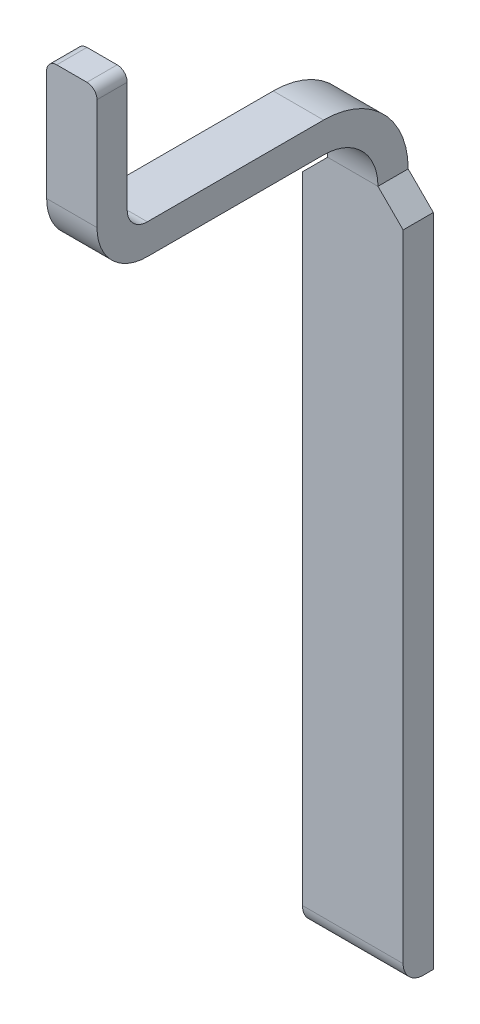
ISO-10303-21;
HEADER;
FILE_DESCRIPTION(('STEP AP214'),'2;1');
FILE_NAME('part.step','',(''),(''),'','','');
FILE_SCHEMA(('AUTOMOTIVE_DESIGN { 1 0 10303 214 1 1 1 1 }'));
ENDSEC;
DATA;
#1=APPLICATION_CONTEXT('core data for automotive mechanical design processes');
#2=APPLICATION_PROTOCOL_DEFINITION('international standard','automotive_design',2000,#1);
#3=PRODUCT_CONTEXT('',#1,'mechanical');
#4=PRODUCT('Part','Part','',(#3));
#5=PRODUCT_RELATED_PRODUCT_CATEGORY('part','',(#4));
#6=PRODUCT_DEFINITION_FORMATION('','',#4);
#7=PRODUCT_DEFINITION_CONTEXT('part definition',#1,'design');
#8=PRODUCT_DEFINITION('design','',#6,#7);
#9=PRODUCT_DEFINITION_SHAPE('','',#8);
#10=(LENGTH_UNIT() NAMED_UNIT(*) SI_UNIT(.MILLI.,.METRE.));
#11=(NAMED_UNIT(*) PLANE_ANGLE_UNIT() SI_UNIT($,.RADIAN.));
#12=(NAMED_UNIT(*) SI_UNIT($,.STERADIAN.) SOLID_ANGLE_UNIT());
#13=UNCERTAINTY_MEASURE_WITH_UNIT(LENGTH_MEASURE(1.E-05),#10,'distance_accuracy_value','');
#14=(GEOMETRIC_REPRESENTATION_CONTEXT(3) GLOBAL_UNCERTAINTY_ASSIGNED_CONTEXT((#13)) GLOBAL_UNIT_ASSIGNED_CONTEXT((#10,
#11,#12)) REPRESENTATION_CONTEXT('',''));
#15=CARTESIAN_POINT('',(0.,0.,0.));
#16=DIRECTION('',(0.,0.,1.));
#17=DIRECTION('',(1.,0.,0.));
#18=AXIS2_PLACEMENT_3D('',#15,#16,#17);
#19=CARTESIAN_POINT('',(0.9,2.03,-0.12));
#20=DIRECTION('',(0.,0.,-1.));
#21=DIRECTION('',(-1.,0.,0.));
#22=AXIS2_PLACEMENT_3D('',#19,#20,#21);
#23=PLANE('',#22);
#24=DIRECTION('',(0.,-1.,0.));
#25=VECTOR('',#24,1.);
#26=CARTESIAN_POINT('',(0.4,2.03,-0.12));
#27=LINE('',#26,#25);
#28=CARTESIAN_POINT('',(0.4,1.905,-0.12));
#29=VERTEX_POINT('',#28);
#30=CARTESIAN_POINT('',(0.4,-1.25,-0.12));
#31=VERTEX_POINT('',#30);
#32=EDGE_CURVE('E11',#29,#31,#27,.T.);
#33=ORIENTED_EDGE('',*,*,#32,.T.);
#34=DIRECTION('',(1.,0.,0.));
#35=VECTOR('',#34,1.);
#36=CARTESIAN_POINT('',(0.9,-1.25,-0.12));
#37=LINE('',#36,#35);
#38=CARTESIAN_POINT('',(0.9,-1.25,-0.12));
#39=VERTEX_POINT('',#38);
#40=EDGE_CURVE('E255',#31,#39,#37,.T.);
#41=ORIENTED_EDGE('',*,*,#40,.T.);
#42=DIRECTION('',(0.,-1.,0.));
#43=VECTOR('',#42,1.);
#44=CARTESIAN_POINT('',(0.9,2.03,-0.12));
#45=LINE('',#44,#43);
#46=CARTESIAN_POINT('',(0.9,1.905,-0.12));
#47=VERTEX_POINT('',#46);
#48=EDGE_CURVE('E26',#47,#39,#45,.T.);
#49=ORIENTED_EDGE('',*,*,#48,.F.);
#50=DIRECTION('',(-0.707106781186547,0.707106781186548,0.));
#51=VECTOR('',#50,1.);
#52=CARTESIAN_POINT('',(0.9,1.905,-0.12));
#53=LINE('',#52,#51);
#54=CARTESIAN_POINT('',(0.775,2.03,-0.12));
#55=VERTEX_POINT('',#54);
#56=EDGE_CURVE('E224',#47,#55,#53,.T.);
#57=ORIENTED_EDGE('',*,*,#56,.T.);
#58=DIRECTION('',(-1.,0.,0.));
#59=VECTOR('',#58,1.);
#60=CARTESIAN_POINT('',(0.9,2.03,-0.12));
#61=LINE('',#60,#59);
#62=CARTESIAN_POINT('',(0.525,2.03,-0.12));
#63=VERTEX_POINT('',#62);
#64=EDGE_CURVE('E263',#55,#63,#61,.T.);
#65=ORIENTED_EDGE('',*,*,#64,.T.);
#66=DIRECTION('',(-0.707106781186547,-0.707106781186548,0.));
#67=VECTOR('',#66,1.);
#68=CARTESIAN_POINT('',(0.525,2.03,-0.12));
#69=LINE('',#68,#67);
#70=EDGE_CURVE('E264',#63,#29,#69,.T.);
#71=ORIENTED_EDGE('',*,*,#70,.T.);
#72=EDGE_LOOP('',(#33,#41,#49,#57,#65,#71));
#73=FACE_BOUND('',#72,.T.);
#74=ADVANCED_FACE('F16',(#73),#23,.F.);
#75=CARTESIAN_POINT('',(0.4,-1.35,-0.27));
#76=DIRECTION('',(1.,0.,0.));
#77=DIRECTION('',(0.,-1.,0.));
#78=AXIS2_PLACEMENT_3D('',#75,#76,#77);
#79=PLANE('',#78);
#80=DIRECTION('',(0.,0.,-1.));
#81=VECTOR('',#80,1.);
#82=CARTESIAN_POINT('',(0.4,-1.35,-0.12));
#83=LINE('',#82,#81);
#84=CARTESIAN_POINT('',(0.4,-1.35,-0.22));
#85=VERTEX_POINT('',#84);
#86=CARTESIAN_POINT('',(0.4,-1.35,-0.27));
#87=VERTEX_POINT('',#86);
#88=EDGE_CURVE('E269',#85,#87,#83,.T.);
#89=ORIENTED_EDGE('',*,*,#88,.F.);
#90=CARTESIAN_POINT('',(0.4,-1.25,-0.22));
#91=DIRECTION('',(-1.,0.,0.));
#92=DIRECTION('',(0.,1.,0.));
#93=AXIS2_PLACEMENT_3D('',#90,#91,#92);
#94=CIRCLE('',#93,0.1);
#95=EDGE_CURVE('E214',#85,#31,#94,.T.);
#96=ORIENTED_EDGE('',*,*,#95,.T.);
#97=ORIENTED_EDGE('',*,*,#32,.F.);
#98=DIRECTION('',(0.,0.,-1.));
#99=VECTOR('',#98,1.);
#100=CARTESIAN_POINT('',(0.4,1.905,-0.27));
#101=LINE('',#100,#99);
#102=CARTESIAN_POINT('',(0.4,1.905,-0.27));
#103=VERTEX_POINT('',#102);
#104=EDGE_CURVE('E222',#29,#103,#101,.T.);
#105=ORIENTED_EDGE('',*,*,#104,.T.);
#106=DIRECTION('',(0.,1.,0.));
#107=VECTOR('',#106,1.);
#108=CARTESIAN_POINT('',(0.4,-1.35,-0.27));
#109=LINE('',#108,#107);
#110=EDGE_CURVE('E377',#87,#103,#109,.T.);
#111=ORIENTED_EDGE('',*,*,#110,.F.);
#112=EDGE_LOOP('',(#89,#96,#97,#105,#111));
#113=FACE_BOUND('',#112,.T.);
#114=ADVANCED_FACE('F459',(#113),#79,.F.);
#115=CARTESIAN_POINT('',(0.9,-1.35,-0.27));
#116=DIRECTION('',(1.,0.,0.));
#117=DIRECTION('',(0.,-1.,0.));
#118=AXIS2_PLACEMENT_3D('',#115,#116,#117);
#119=PLANE('',#118);
#120=ORIENTED_EDGE('',*,*,#48,.T.);
#121=CARTESIAN_POINT('',(0.9,-1.25,-0.22));
#122=DIRECTION('',(1.,0.,0.));
#123=DIRECTION('',(0.,1.,0.));
#124=AXIS2_PLACEMENT_3D('',#121,#122,#123);
#125=CIRCLE('',#124,0.1);
#126=CARTESIAN_POINT('',(0.9,-1.35,-0.22));
#127=VERTEX_POINT('',#126);
#128=EDGE_CURVE('E367',#39,#127,#125,.T.);
#129=ORIENTED_EDGE('',*,*,#128,.T.);
#130=DIRECTION('',(0.,0.,-1.));
#131=VECTOR('',#130,1.);
#132=CARTESIAN_POINT('',(0.9,-1.35,-0.12));
#133=LINE('',#132,#131);
#134=CARTESIAN_POINT('',(0.9,-1.35,-0.27));
#135=VERTEX_POINT('',#134);
#136=EDGE_CURVE('E197',#127,#135,#133,.T.);
#137=ORIENTED_EDGE('',*,*,#136,.T.);
#138=DIRECTION('',(0.,1.,0.));
#139=VECTOR('',#138,1.);
#140=CARTESIAN_POINT('',(0.9,-1.35,-0.27));
#141=LINE('',#140,#139);
#142=CARTESIAN_POINT('',(0.9,1.905,-0.27));
#143=VERTEX_POINT('',#142);
#144=EDGE_CURVE('E219',#135,#143,#141,.T.);
#145=ORIENTED_EDGE('',*,*,#144,.T.);
#146=DIRECTION('',(0.,0.,1.));
#147=VECTOR('',#146,1.);
#148=CARTESIAN_POINT('',(0.9,1.905,-0.12));
#149=LINE('',#148,#147);
#150=EDGE_CURVE('E227',#143,#47,#149,.T.);
#151=ORIENTED_EDGE('',*,*,#150,.T.);
#152=EDGE_LOOP('',(#120,#129,#137,#145,#151));
#153=FACE_BOUND('',#152,.T.);
#154=ADVANCED_FACE('F454',(#153),#119,.T.);
#155=CARTESIAN_POINT('',(0.775,2.03,0.15));
#156=DIRECTION('',(1.,0.,0.));
#157=DIRECTION('',(0.,0.,1.));
#158=AXIS2_PLACEMENT_3D('',#155,#156,#157);
#159=CYLINDRICAL_SURFACE('',#158,0.27);
#160=CARTESIAN_POINT('',(0.525,2.03,0.15));
#161=DIRECTION('',(1.,0.,0.));
#162=DIRECTION('',(0.,-1.,0.));
#163=AXIS2_PLACEMENT_3D('',#160,#161,#162);
#164=CIRCLE('',#163,0.27);
#165=CARTESIAN_POINT('',(0.525,2.3,0.15));
#166=VERTEX_POINT('',#165);
#167=EDGE_CURVE('E246',#63,#166,#164,.T.);
#168=ORIENTED_EDGE('',*,*,#167,.F.);
#169=ORIENTED_EDGE('',*,*,#64,.F.);
#170=CARTESIAN_POINT('',(0.775,2.03,0.15));
#171=DIRECTION('',(1.,0.,0.));
#172=DIRECTION('',(0.,-1.,0.));
#173=AXIS2_PLACEMENT_3D('',#170,#171,#172);
#174=CIRCLE('',#173,0.27);
#175=CARTESIAN_POINT('',(0.775,2.3,0.15));
#176=VERTEX_POINT('',#175);
#177=EDGE_CURVE('E247',#55,#176,#174,.T.);
#178=ORIENTED_EDGE('',*,*,#177,.T.);
#179=DIRECTION('',(-1.,0.,0.));
#180=VECTOR('',#179,1.);
#181=CARTESIAN_POINT('',(0.775,2.3,0.15));
#182=LINE('',#181,#180);
#183=EDGE_CURVE('E51',#176,#166,#182,.T.);
#184=ORIENTED_EDGE('',*,*,#183,.T.);
#185=EDGE_LOOP('',(#168,#169,#178,#184));
#186=FACE_BOUND('',#185,.T.);
#187=ADVANCED_FACE('F390',(#186),#159,.F.);
#188=CARTESIAN_POINT('',(0.775,2.3,0.15));
#189=DIRECTION('',(0.,-1.,0.));
#190=DIRECTION('',(0.,0.,-1.));
#191=AXIS2_PLACEMENT_3D('',#188,#189,#190);
#192=PLANE('',#191);
#193=DIRECTION('',(0.,0.,1.));
#194=VECTOR('',#193,1.);
#195=CARTESIAN_POINT('',(0.525,2.3,0.15));
#196=LINE('',#195,#194);
#197=CARTESIAN_POINT('',(0.525,2.3,1.025));
#198=VERTEX_POINT('',#197);
#199=EDGE_CURVE('E241',#166,#198,#196,.T.);
#200=ORIENTED_EDGE('',*,*,#199,.F.);
#201=ORIENTED_EDGE('',*,*,#183,.F.);
#202=DIRECTION('',(0.,0.,1.));
#203=VECTOR('',#202,1.);
#204=CARTESIAN_POINT('',(0.775,2.3,0.15));
#205=LINE('',#204,#203);
#206=CARTESIAN_POINT('',(0.775,2.3,1.025));
#207=VERTEX_POINT('',#206);
#208=EDGE_CURVE('E251',#176,#207,#205,.T.);
#209=ORIENTED_EDGE('',*,*,#208,.T.);
#210=DIRECTION('',(-1.,0.,0.));
#211=VECTOR('',#210,1.);
#212=CARTESIAN_POINT('',(0.775,2.3,1.025));
#213=LINE('',#212,#211);
#214=EDGE_CURVE('E371',#207,#198,#213,.T.);
#215=ORIENTED_EDGE('',*,*,#214,.T.);
#216=EDGE_LOOP('',(#200,#201,#209,#215));
#217=FACE_BOUND('',#216,.T.);
#218=ADVANCED_FACE('F428',(#217),#192,.T.);
#219=CARTESIAN_POINT('',(0.775,2.55,1.025));
#220=DIRECTION('',(1.,0.,0.));
#221=DIRECTION('',(0.,0.,1.));
#222=AXIS2_PLACEMENT_3D('',#219,#220,#221);
#223=CYLINDRICAL_SURFACE('',#222,0.25);
#224=CARTESIAN_POINT('',(0.525,2.55,1.025));
#225=DIRECTION('',(-1.,0.,0.));
#226=DIRECTION('',(0.,1.,0.));
#227=AXIS2_PLACEMENT_3D('',#224,#225,#226);
#228=CIRCLE('',#227,0.25);
#229=CARTESIAN_POINT('',(0.525,2.55,1.275));
#230=VERTEX_POINT('',#229);
#231=EDGE_CURVE('E245',#198,#230,#228,.T.);
#232=ORIENTED_EDGE('',*,*,#231,.F.);
#233=ORIENTED_EDGE('',*,*,#214,.F.);
#234=CARTESIAN_POINT('',(0.775,2.55,1.025));
#235=DIRECTION('',(-1.,0.,0.));
#236=DIRECTION('',(0.,1.,0.));
#237=AXIS2_PLACEMENT_3D('',#234,#235,#236);
#238=CIRCLE('',#237,0.25);
#239=CARTESIAN_POINT('',(0.775,2.55,1.275));
#240=VERTEX_POINT('',#239);
#241=EDGE_CURVE('E301',#207,#240,#238,.T.);
#242=ORIENTED_EDGE('',*,*,#241,.T.);
#243=DIRECTION('',(-1.,0.,0.));
#244=VECTOR('',#243,1.);
#245=CARTESIAN_POINT('',(0.775,2.55,1.275));
#246=LINE('',#245,#244);
#247=EDGE_CURVE('E186',#240,#230,#246,.T.);
#248=ORIENTED_EDGE('',*,*,#247,.T.);
#249=EDGE_LOOP('',(#232,#233,#242,#248));
#250=FACE_BOUND('',#249,.T.);
#251=ADVANCED_FACE('F405',(#250),#223,.T.);
#252=CARTESIAN_POINT('',(0.775,2.55,1.275));
#253=DIRECTION('',(0.,0.,1.));
#254=DIRECTION('',(0.,-1.,0.));
#255=AXIS2_PLACEMENT_3D('',#252,#253,#254);
#256=PLANE('',#255);
#257=DIRECTION('',(0.,1.,0.));
#258=VECTOR('',#257,1.);
#259=CARTESIAN_POINT('',(0.775,2.55,1.275));
#260=LINE('',#259,#258);
#261=CARTESIAN_POINT('',(0.775,3.1,1.275));
#262=VERTEX_POINT('',#261);
#263=EDGE_CURVE('E201',#240,#262,#260,.T.);
#264=ORIENTED_EDGE('',*,*,#263,.T.);
#265=CARTESIAN_POINT('',(0.725,3.1,1.275));
#266=DIRECTION('',(0.,0.,1.));
#267=DIRECTION('',(0.,-1.,0.));
#268=AXIS2_PLACEMENT_3D('',#265,#266,#267);
#269=CIRCLE('',#268,0.05);
#270=CARTESIAN_POINT('',(0.725,3.15,1.275));
#271=VERTEX_POINT('',#270);
#272=EDGE_CURVE('E193',#262,#271,#269,.T.);
#273=ORIENTED_EDGE('',*,*,#272,.T.);
#274=DIRECTION('',(-1.,0.,0.));
#275=VECTOR('',#274,1.);
#276=CARTESIAN_POINT('',(0.775,3.15,1.275));
#277=LINE('',#276,#275);
#278=CARTESIAN_POINT('',(0.575,3.15,1.275));
#279=VERTEX_POINT('',#278);
#280=EDGE_CURVE('E129',#271,#279,#277,.T.);
#281=ORIENTED_EDGE('',*,*,#280,.T.);
#282=CARTESIAN_POINT('',(0.575,3.1,1.275));
#283=DIRECTION('',(0.,0.,1.));
#284=DIRECTION('',(0.,-1.,0.));
#285=AXIS2_PLACEMENT_3D('',#282,#283,#284);
#286=CIRCLE('',#285,0.05);
#287=CARTESIAN_POINT('',(0.525,3.1,1.275));
#288=VERTEX_POINT('',#287);
#289=EDGE_CURVE('E229',#279,#288,#286,.T.);
#290=ORIENTED_EDGE('',*,*,#289,.T.);
#291=DIRECTION('',(0.,1.,0.));
#292=VECTOR('',#291,1.);
#293=CARTESIAN_POINT('',(0.525,2.55,1.275));
#294=LINE('',#293,#292);
#295=EDGE_CURVE('E277',#230,#288,#294,.T.);
#296=ORIENTED_EDGE('',*,*,#295,.F.);
#297=ORIENTED_EDGE('',*,*,#247,.F.);
#298=EDGE_LOOP('',(#264,#273,#281,#290,#296,#297));
#299=FACE_BOUND('',#298,.T.);
#300=ADVANCED_FACE('F18',(#299),#256,.T.);
#301=CARTESIAN_POINT('',(0.775,3.15,1.275));
#302=DIRECTION('',(0.,1.,0.));
#303=DIRECTION('',(1.,0.,0.));
#304=AXIS2_PLACEMENT_3D('',#301,#302,#303);
#305=PLANE('',#304);
#306=ORIENTED_EDGE('',*,*,#280,.F.);
#307=DIRECTION('',(0.,0.,-1.));
#308=VECTOR('',#307,1.);
#309=CARTESIAN_POINT('',(0.725,3.15,1.275));
#310=LINE('',#309,#308);
#311=CARTESIAN_POINT('',(0.725,3.15,1.125));
#312=VERTEX_POINT('',#311);
#313=EDGE_CURVE('E180',#271,#312,#310,.T.);
#314=ORIENTED_EDGE('',*,*,#313,.T.);
#315=DIRECTION('',(-1.,0.,0.));
#316=VECTOR('',#315,1.);
#317=CARTESIAN_POINT('',(0.775,3.15,1.125));
#318=LINE('',#317,#316);
#319=CARTESIAN_POINT('',(0.575,3.15,1.125));
#320=VERTEX_POINT('',#319);
#321=EDGE_CURVE('E187',#312,#320,#318,.T.);
#322=ORIENTED_EDGE('',*,*,#321,.T.);
#323=DIRECTION('',(0.,0.,1.));
#324=VECTOR('',#323,1.);
#325=CARTESIAN_POINT('',(0.575,3.15,1.275));
#326=LINE('',#325,#324);
#327=EDGE_CURVE('E183',#320,#279,#326,.T.);
#328=ORIENTED_EDGE('',*,*,#327,.T.);
#329=EDGE_LOOP('',(#306,#314,#322,#328));
#330=FACE_BOUND('',#329,.T.);
#331=ADVANCED_FACE('F179',(#330),#305,.T.);
#332=CARTESIAN_POINT('',(0.775,2.55,1.125));
#333=DIRECTION('',(0.,0.,-1.));
#334=DIRECTION('',(0.,-1.,0.));
#335=AXIS2_PLACEMENT_3D('',#332,#333,#334);
#336=PLANE('',#335);
#337=ORIENTED_EDGE('',*,*,#321,.F.);
#338=CARTESIAN_POINT('',(0.725,3.1,1.125));
#339=DIRECTION('',(0.,0.,-1.));
#340=DIRECTION('',(0.,1.,0.));
#341=AXIS2_PLACEMENT_3D('',#338,#339,#340);
#342=CIRCLE('',#341,0.05);
#343=CARTESIAN_POINT('',(0.775,3.1,1.125));
#344=VERTEX_POINT('',#343);
#345=EDGE_CURVE('E195',#312,#344,#342,.T.);
#346=ORIENTED_EDGE('',*,*,#345,.T.);
#347=DIRECTION('',(0.,-1.,0.));
#348=VECTOR('',#347,1.);
#349=CARTESIAN_POINT('',(0.775,2.55,1.125));
#350=LINE('',#349,#348);
#351=CARTESIAN_POINT('',(0.775,2.55,1.125));
#352=VERTEX_POINT('',#351);
#353=EDGE_CURVE('E285',#344,#352,#350,.T.);
#354=ORIENTED_EDGE('',*,*,#353,.T.);
#355=DIRECTION('',(-1.,0.,0.));
#356=VECTOR('',#355,1.);
#357=CARTESIAN_POINT('',(0.775,2.55,1.125));
#358=LINE('',#357,#356);
#359=CARTESIAN_POINT('',(0.525,2.55,1.125));
#360=VERTEX_POINT('',#359);
#361=EDGE_CURVE('E239',#352,#360,#358,.T.);
#362=ORIENTED_EDGE('',*,*,#361,.T.);
#363=DIRECTION('',(0.,-1.,0.));
#364=VECTOR('',#363,1.);
#365=CARTESIAN_POINT('',(0.525,2.55,1.125));
#366=LINE('',#365,#364);
#367=CARTESIAN_POINT('',(0.525,3.1,1.125));
#368=VERTEX_POINT('',#367);
#369=EDGE_CURVE('E280',#368,#360,#366,.T.);
#370=ORIENTED_EDGE('',*,*,#369,.F.);
#371=CARTESIAN_POINT('',(0.575,3.1,1.125));
#372=DIRECTION('',(0.,0.,-1.));
#373=DIRECTION('',(0.,1.,0.));
#374=AXIS2_PLACEMENT_3D('',#371,#372,#373);
#375=CIRCLE('',#374,0.05);
#376=EDGE_CURVE('E293',#368,#320,#375,.T.);
#377=ORIENTED_EDGE('',*,*,#376,.T.);
#378=EDGE_LOOP('',(#337,#346,#354,#362,#370,#377));
#379=FACE_BOUND('',#378,.T.);
#380=ADVANCED_FACE('F335',(#379),#336,.T.);
#381=CARTESIAN_POINT('',(0.775,2.55,1.025));
#382=DIRECTION('',(1.,0.,0.));
#383=DIRECTION('',(0.,0.,1.));
#384=AXIS2_PLACEMENT_3D('',#381,#382,#383);
#385=CYLINDRICAL_SURFACE('',#384,0.1);
#386=CARTESIAN_POINT('',(0.525,2.55,1.025));
#387=DIRECTION('',(1.,0.,0.));
#388=DIRECTION('',(0.,1.,0.));
#389=AXIS2_PLACEMENT_3D('',#386,#387,#388);
#390=CIRCLE('',#389,0.1);
#391=CARTESIAN_POINT('',(0.525,2.45,1.025));
#392=VERTEX_POINT('',#391);
#393=EDGE_CURVE('E237',#360,#392,#390,.T.);
#394=ORIENTED_EDGE('',*,*,#393,.F.);
#395=ORIENTED_EDGE('',*,*,#361,.F.);
#396=CARTESIAN_POINT('',(0.775,2.55,1.025));
#397=DIRECTION('',(1.,0.,0.));
#398=DIRECTION('',(0.,1.,0.));
#399=AXIS2_PLACEMENT_3D('',#396,#397,#398);
#400=CIRCLE('',#399,0.1);
#401=CARTESIAN_POINT('',(0.775,2.45,1.025));
#402=VERTEX_POINT('',#401);
#403=EDGE_CURVE('E274',#352,#402,#400,.T.);
#404=ORIENTED_EDGE('',*,*,#403,.T.);
#405=DIRECTION('',(-1.,0.,0.));
#406=VECTOR('',#405,1.);
#407=CARTESIAN_POINT('',(0.775,2.45,1.025));
#408=LINE('',#407,#406);
#409=EDGE_CURVE('E20',#402,#392,#408,.T.);
#410=ORIENTED_EDGE('',*,*,#409,.T.);
#411=EDGE_LOOP('',(#394,#395,#404,#410));
#412=FACE_BOUND('',#411,.T.);
#413=ADVANCED_FACE('F343',(#412),#385,.F.);
#414=CARTESIAN_POINT('',(0.775,2.45,0.15));
#415=DIRECTION('',(0.,1.,0.));
#416=DIRECTION('',(1.,0.,0.));
#417=AXIS2_PLACEMENT_3D('',#414,#415,#416);
#418=PLANE('',#417);
#419=DIRECTION('',(0.,0.,-1.));
#420=VECTOR('',#419,1.);
#421=CARTESIAN_POINT('',(0.525,2.45,0.15));
#422=LINE('',#421,#420);
#423=CARTESIAN_POINT('',(0.525,2.45,0.15));
#424=VERTEX_POINT('',#423);
#425=EDGE_CURVE('E232',#392,#424,#422,.T.);
#426=ORIENTED_EDGE('',*,*,#425,.F.);
#427=ORIENTED_EDGE('',*,*,#409,.F.);
#428=DIRECTION('',(0.,0.,-1.));
#429=VECTOR('',#428,1.);
#430=CARTESIAN_POINT('',(0.775,2.45,0.15));
#431=LINE('',#430,#429);
#432=CARTESIAN_POINT('',(0.775,2.45,0.15));
#433=VERTEX_POINT('',#432);
#434=EDGE_CURVE('E250',#402,#433,#431,.T.);
#435=ORIENTED_EDGE('',*,*,#434,.T.);
#436=DIRECTION('',(-1.,0.,0.));
#437=VECTOR('',#436,1.);
#438=CARTESIAN_POINT('',(0.775,2.45,0.15));
#439=LINE('',#438,#437);
#440=EDGE_CURVE('E286',#433,#424,#439,.T.);
#441=ORIENTED_EDGE('',*,*,#440,.T.);
#442=EDGE_LOOP('',(#426,#427,#435,#441));
#443=FACE_BOUND('',#442,.T.);
#444=ADVANCED_FACE('F474',(#443),#418,.T.);
#445=CARTESIAN_POINT('',(0.775,2.03,0.15));
#446=DIRECTION('',(1.,0.,0.));
#447=DIRECTION('',(0.,-1.,0.));
#448=AXIS2_PLACEMENT_3D('',#445,#446,#447);
#449=PLANE('',#448);
#450=ORIENTED_EDGE('',*,*,#353,.F.);
#451=DIRECTION('',(0.,0.,1.));
#452=VECTOR('',#451,1.);
#453=CARTESIAN_POINT('',(0.775,3.1,0.15));
#454=LINE('',#453,#452);
#455=EDGE_CURVE('E204',#344,#262,#454,.T.);
#456=ORIENTED_EDGE('',*,*,#455,.T.);
#457=ORIENTED_EDGE('',*,*,#263,.F.);
#458=ORIENTED_EDGE('',*,*,#241,.F.);
#459=ORIENTED_EDGE('',*,*,#208,.F.);
#460=ORIENTED_EDGE('',*,*,#177,.F.);
#461=DIRECTION('',(0.,0.,-1.));
#462=VECTOR('',#461,1.);
#463=CARTESIAN_POINT('',(0.775,2.03,-0.27));
#464=LINE('',#463,#462);
#465=CARTESIAN_POINT('',(0.775,2.03,-0.27));
#466=VERTEX_POINT('',#465);
#467=EDGE_CURVE('E228',#55,#466,#464,.T.);
#468=ORIENTED_EDGE('',*,*,#467,.T.);
#469=CARTESIAN_POINT('',(0.775,2.03,0.15));
#470=DIRECTION('',(-1.,0.,0.));
#471=DIRECTION('',(0.,-1.,0.));
#472=AXIS2_PLACEMENT_3D('',#469,#470,#471);
#473=CIRCLE('',#472,0.42);
#474=EDGE_CURVE('E282',#433,#466,#473,.T.);
#475=ORIENTED_EDGE('',*,*,#474,.F.);
#476=ORIENTED_EDGE('',*,*,#434,.F.);
#477=ORIENTED_EDGE('',*,*,#403,.F.);
#478=EDGE_LOOP('',(#450,#456,#457,#458,#459,#460,#468,#475,#476,#477));
#479=FACE_BOUND('',#478,.T.);
#480=ADVANCED_FACE('F339',(#479),#449,.T.);
#481=CARTESIAN_POINT('',(0.775,2.03,0.15));
#482=DIRECTION('',(1.,0.,0.));
#483=DIRECTION('',(0.,0.,1.));
#484=AXIS2_PLACEMENT_3D('',#481,#482,#483);
#485=CYLINDRICAL_SURFACE('',#484,0.42);
#486=CARTESIAN_POINT('',(0.525,2.03,0.15));
#487=DIRECTION('',(-1.,0.,0.));
#488=DIRECTION('',(0.,-1.,0.));
#489=AXIS2_PLACEMENT_3D('',#486,#487,#488);
#490=CIRCLE('',#489,0.42);
#491=CARTESIAN_POINT('',(0.525,2.03,-0.27));
#492=VERTEX_POINT('',#491);
#493=EDGE_CURVE('E236',#424,#492,#490,.T.);
#494=ORIENTED_EDGE('',*,*,#493,.F.);
#495=ORIENTED_EDGE('',*,*,#440,.F.);
#496=ORIENTED_EDGE('',*,*,#474,.T.);
#497=DIRECTION('',(-1.,0.,0.));
#498=VECTOR('',#497,1.);
#499=CARTESIAN_POINT('',(0.9,2.03,-0.27));
#500=LINE('',#499,#498);
#501=EDGE_CURVE('E256',#466,#492,#500,.T.);
#502=ORIENTED_EDGE('',*,*,#501,.T.);
#503=EDGE_LOOP('',(#494,#495,#496,#502));
#504=FACE_BOUND('',#503,.T.);
#505=ADVANCED_FACE('F484',(#504),#485,.T.);
#506=CARTESIAN_POINT('',(0.525,2.03,0.15));
#507=DIRECTION('',(1.,0.,0.));
#508=DIRECTION('',(0.,-1.,0.));
#509=AXIS2_PLACEMENT_3D('',#506,#507,#508);
#510=PLANE('',#509);
#511=ORIENTED_EDGE('',*,*,#295,.T.);
#512=DIRECTION('',(0.,0.,-1.));
#513=VECTOR('',#512,1.);
#514=CARTESIAN_POINT('',(0.525,3.1,1.125));
#515=LINE('',#514,#513);
#516=EDGE_CURVE('E281',#288,#368,#515,.T.);
#517=ORIENTED_EDGE('',*,*,#516,.T.);
#518=ORIENTED_EDGE('',*,*,#369,.T.);
#519=ORIENTED_EDGE('',*,*,#393,.T.);
#520=ORIENTED_EDGE('',*,*,#425,.T.);
#521=ORIENTED_EDGE('',*,*,#493,.T.);
#522=DIRECTION('',(0.,0.,1.));
#523=VECTOR('',#522,1.);
#524=CARTESIAN_POINT('',(0.525,2.03,-0.27));
#525=LINE('',#524,#523);
#526=EDGE_CURVE('E268',#492,#63,#525,.T.);
#527=ORIENTED_EDGE('',*,*,#526,.T.);
#528=ORIENTED_EDGE('',*,*,#167,.T.);
#529=ORIENTED_EDGE('',*,*,#199,.T.);
#530=ORIENTED_EDGE('',*,*,#231,.T.);
#531=EDGE_LOOP('',(#511,#517,#518,#519,#520,#521,#527,#528,#529,#530));
#532=FACE_BOUND('',#531,.T.);
#533=ADVANCED_FACE('F348',(#532),#510,.F.);
#534=CARTESIAN_POINT('',(0.575,3.1,0.15));
#535=DIRECTION('',(0.,0.,-1.));
#536=DIRECTION('',(1.,0.,0.));
#537=AXIS2_PLACEMENT_3D('',#534,#535,#536);
#538=CYLINDRICAL_SURFACE('',#537,0.05);
#539=ORIENTED_EDGE('',*,*,#289,.F.);
#540=ORIENTED_EDGE('',*,*,#327,.F.);
#541=ORIENTED_EDGE('',*,*,#376,.F.);
#542=ORIENTED_EDGE('',*,*,#516,.F.);
#543=EDGE_LOOP('',(#539,#540,#541,#542));
#544=FACE_BOUND('',#543,.T.);
#545=ADVANCED_FACE('F352',(#544),#538,.T.);
#546=CARTESIAN_POINT('',(0.9,1.905,-0.27));
#547=DIRECTION('',(0.707106781186548,0.707106781186547,0.));
#548=DIRECTION('',(0.,0.,-1.));
#549=AXIS2_PLACEMENT_3D('',#546,#547,#548);
#550=PLANE('',#549);
#551=DIRECTION('',(0.707106781186547,-0.707106781186548,0.));
#552=VECTOR('',#551,1.);
#553=CARTESIAN_POINT('',(0.9,1.905,-0.27));
#554=LINE('',#553,#552);
#555=EDGE_CURVE('E223',#466,#143,#554,.T.);
#556=ORIENTED_EDGE('',*,*,#555,.F.);
#557=ORIENTED_EDGE('',*,*,#467,.F.);
#558=ORIENTED_EDGE('',*,*,#56,.F.);
#559=ORIENTED_EDGE('',*,*,#150,.F.);
#560=EDGE_LOOP('',(#556,#557,#558,#559));
#561=FACE_BOUND('',#560,.T.);
#562=ADVANCED_FACE('F418',(#561),#550,.T.);
#563=CARTESIAN_POINT('',(0.525,2.03,-0.27));
#564=DIRECTION('',(0.707106781186548,-0.707106781186547,0.));
#565=DIRECTION('',(0.,0.,-1.));
#566=AXIS2_PLACEMENT_3D('',#563,#564,#565);
#567=PLANE('',#566);
#568=DIRECTION('',(0.707106781186547,0.707106781186548,0.));
#569=VECTOR('',#568,1.);
#570=CARTESIAN_POINT('',(0.525,2.03,-0.27));
#571=LINE('',#570,#569);
#572=EDGE_CURVE('E260',#103,#492,#571,.T.);
#573=ORIENTED_EDGE('',*,*,#572,.F.);
#574=ORIENTED_EDGE('',*,*,#104,.F.);
#575=ORIENTED_EDGE('',*,*,#70,.F.);
#576=ORIENTED_EDGE('',*,*,#526,.F.);
#577=EDGE_LOOP('',(#573,#574,#575,#576));
#578=FACE_BOUND('',#577,.T.);
#579=ADVANCED_FACE('F412',(#578),#567,.F.);
#580=CARTESIAN_POINT('',(0.9,-1.35,-0.27));
#581=DIRECTION('',(0.,0.,1.));
#582=DIRECTION('',(0.,-1.,0.));
#583=AXIS2_PLACEMENT_3D('',#580,#581,#582);
#584=PLANE('',#583);
#585=ORIENTED_EDGE('',*,*,#110,.T.);
#586=ORIENTED_EDGE('',*,*,#572,.T.);
#587=ORIENTED_EDGE('',*,*,#501,.F.);
#588=ORIENTED_EDGE('',*,*,#555,.T.);
#589=ORIENTED_EDGE('',*,*,#144,.F.);
#590=DIRECTION('',(-1.,0.,0.));
#591=VECTOR('',#590,1.);
#592=CARTESIAN_POINT('',(0.9,-1.35,-0.27));
#593=LINE('',#592,#591);
#594=EDGE_CURVE('E273',#135,#87,#593,.T.);
#595=ORIENTED_EDGE('',*,*,#594,.T.);
#596=EDGE_LOOP('',(#585,#586,#587,#588,#589,#595));
#597=FACE_BOUND('',#596,.T.);
#598=ADVANCED_FACE('F417',(#597),#584,.F.);
#599=CARTESIAN_POINT('',(0.9,-1.35,-0.12));
#600=DIRECTION('',(0.,1.,0.));
#601=DIRECTION('',(1.,0.,0.));
#602=AXIS2_PLACEMENT_3D('',#599,#600,#601);
#603=PLANE('',#602);
#604=ORIENTED_EDGE('',*,*,#136,.F.);
#605=DIRECTION('',(-1.,0.,0.));
#606=VECTOR('',#605,1.);
#607=CARTESIAN_POINT('',(0.9,-1.35,-0.22));
#608=LINE('',#607,#606);
#609=EDGE_CURVE('E205',#127,#85,#608,.T.);
#610=ORIENTED_EDGE('',*,*,#609,.T.);
#611=ORIENTED_EDGE('',*,*,#88,.T.);
#612=ORIENTED_EDGE('',*,*,#594,.F.);
#613=EDGE_LOOP('',(#604,#610,#611,#612));
#614=FACE_BOUND('',#613,.T.);
#615=ADVANCED_FACE('F495',(#614),#603,.F.);
#616=CARTESIAN_POINT('',(0.725,3.1,1.275));
#617=DIRECTION('',(0.,0.,1.));
#618=DIRECTION('',(-1.,0.,0.));
#619=AXIS2_PLACEMENT_3D('',#616,#617,#618);
#620=CYLINDRICAL_SURFACE('',#619,0.05);
#621=ORIENTED_EDGE('',*,*,#272,.F.);
#622=ORIENTED_EDGE('',*,*,#455,.F.);
#623=ORIENTED_EDGE('',*,*,#345,.F.);
#624=ORIENTED_EDGE('',*,*,#313,.F.);
#625=EDGE_LOOP('',(#621,#622,#623,#624));
#626=FACE_BOUND('',#625,.T.);
#627=ADVANCED_FACE('F191',(#626),#620,.T.);
#628=CARTESIAN_POINT('',(0.9,-1.25,-0.22));
#629=DIRECTION('',(1.,0.,0.));
#630=DIRECTION('',(0.,0.,1.));
#631=AXIS2_PLACEMENT_3D('',#628,#629,#630);
#632=CYLINDRICAL_SURFACE('',#631,0.1);
#633=ORIENTED_EDGE('',*,*,#128,.F.);
#634=ORIENTED_EDGE('',*,*,#40,.F.);
#635=ORIENTED_EDGE('',*,*,#95,.F.);
#636=ORIENTED_EDGE('',*,*,#609,.F.);
#637=EDGE_LOOP('',(#633,#634,#635,#636));
#638=FACE_BOUND('',#637,.T.);
#639=ADVANCED_FACE('F434',(#638),#632,.T.);
#640=CLOSED_SHELL('',(#74,#114,#154,#187,#218,#251,#300,#331,#380,#413,#444,#480,#505,#533,#545,
#562,#579,#598,#615,#627,#639));
#641=MANIFOLD_SOLID_BREP('B1',#640);
#642=ADVANCED_BREP_SHAPE_REPRESENTATION('',(#18,#641),#14);
#643=SHAPE_DEFINITION_REPRESENTATION(#9,#642);
ENDSEC;
END-ISO-10303-21;
